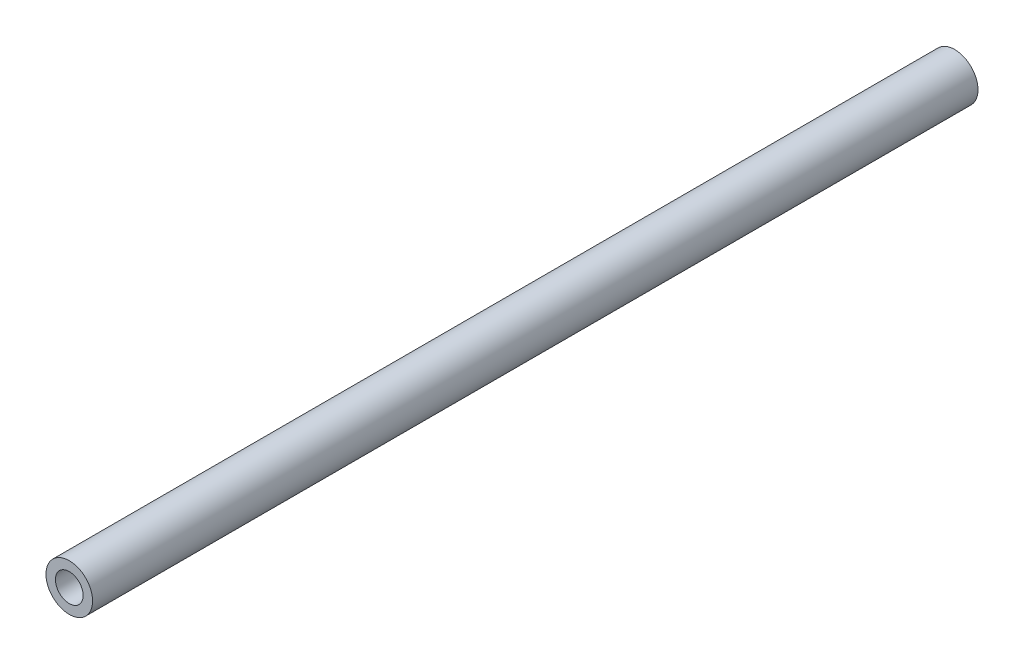
ISO-10303-21;
HEADER;
FILE_DESCRIPTION(('STEP AP214'),'2;1');
FILE_NAME('part.step','',(''),(''),'','','');
FILE_SCHEMA(('AUTOMOTIVE_DESIGN { 1 0 10303 214 1 1 1 1 }'));
ENDSEC;
DATA;
#1=APPLICATION_CONTEXT('core data for automotive mechanical design processes');
#2=APPLICATION_PROTOCOL_DEFINITION('international standard','automotive_design',2000,#1);
#3=PRODUCT_CONTEXT('',#1,'mechanical');
#4=PRODUCT('Part','Part','',(#3));
#5=PRODUCT_RELATED_PRODUCT_CATEGORY('part','',(#4));
#6=PRODUCT_DEFINITION_FORMATION('','',#4);
#7=PRODUCT_DEFINITION_CONTEXT('part definition',#1,'design');
#8=PRODUCT_DEFINITION('design','',#6,#7);
#9=PRODUCT_DEFINITION_SHAPE('','',#8);
#10=(LENGTH_UNIT() NAMED_UNIT(*) SI_UNIT(.MILLI.,.METRE.));
#11=(NAMED_UNIT(*) PLANE_ANGLE_UNIT() SI_UNIT($,.RADIAN.));
#12=(NAMED_UNIT(*) SI_UNIT($,.STERADIAN.) SOLID_ANGLE_UNIT());
#13=UNCERTAINTY_MEASURE_WITH_UNIT(LENGTH_MEASURE(1.E-05),#10,'distance_accuracy_value','');
#14=(GEOMETRIC_REPRESENTATION_CONTEXT(3) GLOBAL_UNCERTAINTY_ASSIGNED_CONTEXT((#13)) GLOBAL_UNIT_ASSIGNED_CONTEXT((#10,
#11,#12)) REPRESENTATION_CONTEXT('',''));
#15=CARTESIAN_POINT('',(0.,0.,0.));
#16=DIRECTION('',(0.,0.,1.));
#17=DIRECTION('',(1.,0.,0.));
#18=AXIS2_PLACEMENT_3D('',#15,#16,#17);
#19=CARTESIAN_POINT('',(0.,0.,300.));
#20=DIRECTION('',(0.,0.,1.));
#21=DIRECTION('',(1.,0.,0.));
#22=AXIS2_PLACEMENT_3D('',#19,#20,#21);
#23=PLANE('',#22);
#24=CARTESIAN_POINT('',(0.,0.,300.));
#25=DIRECTION('',(0.,0.,1.));
#26=DIRECTION('',(1.,0.,0.));
#27=AXIS2_PLACEMENT_3D('',#24,#25,#26);
#28=CIRCLE('',#27,7.9);
#29=CARTESIAN_POINT('',(7.9,0.,300.));
#30=VERTEX_POINT('',#29);
#31=EDGE_CURVE('E10',#30,#30,#28,.T.);
#32=ORIENTED_EDGE('',*,*,#31,.T.);
#33=EDGE_LOOP('',(#32));
#34=FACE_BOUND('',#33,.T.);
#35=CARTESIAN_POINT('',(0.,0.,300.));
#36=DIRECTION('',(0.,0.,1.));
#37=DIRECTION('',(1.,0.,0.));
#38=AXIS2_PLACEMENT_3D('',#35,#36,#37);
#39=CIRCLE('',#38,4.7);
#40=CARTESIAN_POINT('',(4.7,0.,300.));
#41=VERTEX_POINT('',#40);
#42=EDGE_CURVE('E42',#41,#41,#39,.T.);
#43=ORIENTED_EDGE('',*,*,#42,.F.);
#44=EDGE_LOOP('',(#43));
#45=FACE_BOUND('',#44,.T.);
#46=ADVANCED_FACE('F31',(#34,#45),#23,.T.);
#47=CARTESIAN_POINT('',(0.,0.,0.));
#48=DIRECTION('',(0.,0.,1.));
#49=DIRECTION('',(1.,0.,0.));
#50=AXIS2_PLACEMENT_3D('',#47,#48,#49);
#51=PLANE('',#50);
#52=CARTESIAN_POINT('',(0.,0.,0.));
#53=DIRECTION('',(0.,0.,1.));
#54=DIRECTION('',(1.,0.,0.));
#55=AXIS2_PLACEMENT_3D('',#52,#53,#54);
#56=CIRCLE('',#55,7.9);
#57=CARTESIAN_POINT('',(7.9,0.,0.));
#58=VERTEX_POINT('',#57);
#59=EDGE_CURVE('E35',#58,#58,#56,.T.);
#60=ORIENTED_EDGE('',*,*,#59,.F.);
#61=EDGE_LOOP('',(#60));
#62=FACE_BOUND('',#61,.T.);
#63=CARTESIAN_POINT('',(0.,0.,0.));
#64=DIRECTION('',(0.,0.,1.));
#65=DIRECTION('',(1.,0.,0.));
#66=AXIS2_PLACEMENT_3D('',#63,#64,#65);
#67=CIRCLE('',#66,4.7);
#68=CARTESIAN_POINT('',(4.7,0.,0.));
#69=VERTEX_POINT('',#68);
#70=EDGE_CURVE('E44',#69,#69,#67,.T.);
#71=ORIENTED_EDGE('',*,*,#70,.T.);
#72=EDGE_LOOP('',(#71));
#73=FACE_BOUND('',#72,.T.);
#74=ADVANCED_FACE('F54',(#62,#73),#51,.F.);
#75=CARTESIAN_POINT('',(0.,0.,300.));
#76=DIRECTION('',(0.,0.,-1.));
#77=DIRECTION('',(-1.,0.,0.));
#78=AXIS2_PLACEMENT_3D('',#75,#76,#77);
#79=CYLINDRICAL_SURFACE('',#78,7.9);
#80=ORIENTED_EDGE('',*,*,#31,.F.);
#81=EDGE_LOOP('',(#80));
#82=FACE_BOUND('',#81,.T.);
#83=ORIENTED_EDGE('',*,*,#59,.T.);
#84=EDGE_LOOP('',(#83));
#85=FACE_BOUND('',#84,.T.);
#86=ADVANCED_FACE('F33',(#82,#85),#79,.T.);
#87=CARTESIAN_POINT('',(0.,0.,300.));
#88=DIRECTION('',(0.,0.,-1.));
#89=DIRECTION('',(-1.,0.,0.));
#90=AXIS2_PLACEMENT_3D('',#87,#88,#89);
#91=CYLINDRICAL_SURFACE('',#90,4.7);
#92=ORIENTED_EDGE('',*,*,#42,.T.);
#93=EDGE_LOOP('',(#92));
#94=FACE_BOUND('',#93,.T.);
#95=ORIENTED_EDGE('',*,*,#70,.F.);
#96=EDGE_LOOP('',(#95));
#97=FACE_BOUND('',#96,.T.);
#98=ADVANCED_FACE('F50',(#94,#97),#91,.F.);
#99=CLOSED_SHELL('',(#46,#74,#86,#98));
#100=MANIFOLD_SOLID_BREP('B2',#99);
#101=ADVANCED_BREP_SHAPE_REPRESENTATION('',(#18,#100),#14);
#102=SHAPE_DEFINITION_REPRESENTATION(#9,#101);
ENDSEC;
END-ISO-10303-21;
